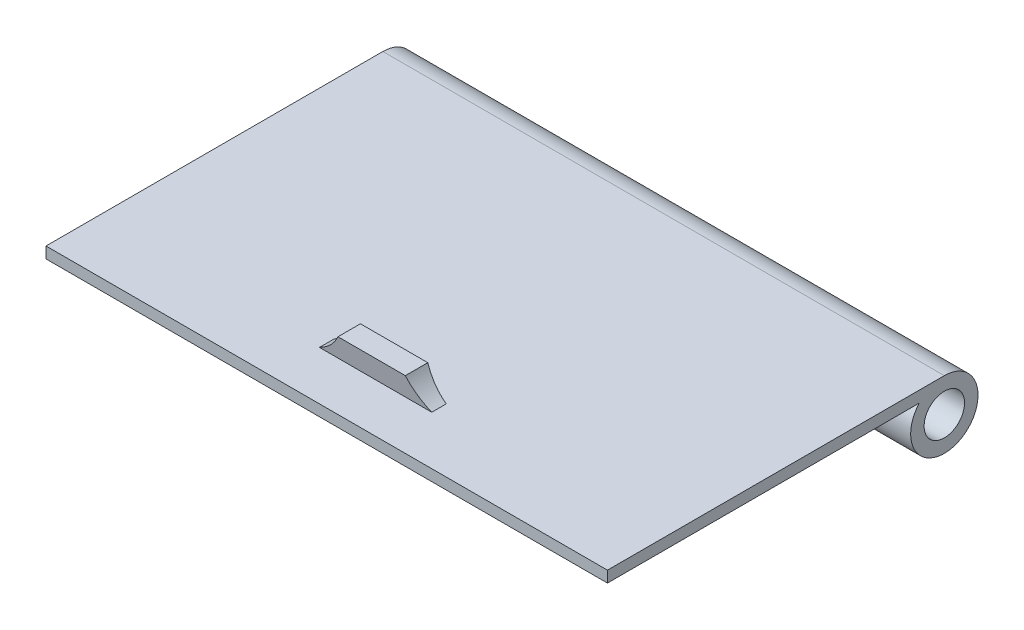
ISO-10303-21;
HEADER;
FILE_DESCRIPTION(('STEP AP214'),'2;1');
FILE_NAME('part.step','',(''),(''),'','','');
FILE_SCHEMA(('AUTOMOTIVE_DESIGN { 1 0 10303 214 1 1 1 1 }'));
ENDSEC;
DATA;
#1=APPLICATION_CONTEXT('core data for automotive mechanical design processes');
#2=APPLICATION_PROTOCOL_DEFINITION('international standard','automotive_design',2000,#1);
#3=PRODUCT_CONTEXT('',#1,'mechanical');
#4=PRODUCT('Part','Part','',(#3));
#5=PRODUCT_RELATED_PRODUCT_CATEGORY('part','',(#4));
#6=PRODUCT_DEFINITION_FORMATION('','',#4);
#7=PRODUCT_DEFINITION_CONTEXT('part definition',#1,'design');
#8=PRODUCT_DEFINITION('design','',#6,#7);
#9=PRODUCT_DEFINITION_SHAPE('','',#8);
#10=(LENGTH_UNIT() NAMED_UNIT(*) SI_UNIT(.MILLI.,.METRE.));
#11=(NAMED_UNIT(*) PLANE_ANGLE_UNIT() SI_UNIT($,.RADIAN.));
#12=(NAMED_UNIT(*) SI_UNIT($,.STERADIAN.) SOLID_ANGLE_UNIT());
#13=UNCERTAINTY_MEASURE_WITH_UNIT(LENGTH_MEASURE(1.E-05),#10,'distance_accuracy_value','');
#14=(GEOMETRIC_REPRESENTATION_CONTEXT(3) GLOBAL_UNCERTAINTY_ASSIGNED_CONTEXT((#13)) GLOBAL_UNIT_ASSIGNED_CONTEXT((#10,
#11,#12)) REPRESENTATION_CONTEXT('',''));
#15=CARTESIAN_POINT('',(0.,0.,0.));
#16=DIRECTION('',(0.,0.,1.));
#17=DIRECTION('',(1.,0.,0.));
#18=AXIS2_PLACEMENT_3D('',#15,#16,#17);
#19=CARTESIAN_POINT('',(0.,2.,0.));
#20=DIRECTION('',(0.,1.,0.));
#21=DIRECTION('',(0.,0.,1.));
#22=AXIS2_PLACEMENT_3D('',#19,#20,#21);
#23=PLANE('',#22);
#24=DIRECTION('',(0.,0.,-1.));
#25=VECTOR('',#24,1.);
#26=CARTESIAN_POINT('',(5.,2.,10.6473460385831));
#27=LINE('',#26,#25);
#28=CARTESIAN_POINT('',(5.,2.,10.6473460385831));
#29=VERTEX_POINT('',#28);
#30=CARTESIAN_POINT('',(5.,2.,9.35265396141693));
#31=VERTEX_POINT('',#30);
#32=EDGE_CURVE('E386',#29,#31,#27,.T.);
#33=ORIENTED_EDGE('',*,*,#32,.F.);
#34=DIRECTION('',(-1.,0.,0.));
#35=VECTOR('',#34,1.);
#36=CARTESIAN_POINT('',(5.,2.,10.6473460385831));
#37=LINE('',#36,#35);
#38=CARTESIAN_POINT('',(-5.,2.,10.6473460385831));
#39=VERTEX_POINT('',#38);
#40=EDGE_CURVE('E145',#29,#39,#37,.T.);
#41=ORIENTED_EDGE('',*,*,#40,.T.);
#42=DIRECTION('',(0.,0.,-1.));
#43=VECTOR('',#42,1.);
#44=CARTESIAN_POINT('',(-5.,2.,10.6473460385831));
#45=LINE('',#44,#43);
#46=CARTESIAN_POINT('',(-5.,2.,9.35265396141693));
#47=VERTEX_POINT('',#46);
#48=EDGE_CURVE('E382',#39,#47,#45,.T.);
#49=ORIENTED_EDGE('',*,*,#48,.T.);
#50=DIRECTION('',(-1.,0.,0.));
#51=VECTOR('',#50,1.);
#52=CARTESIAN_POINT('',(5.,2.,9.35265396141693));
#53=LINE('',#52,#51);
#54=EDGE_CURVE('E137',#31,#47,#53,.T.);
#55=ORIENTED_EDGE('',*,*,#54,.F.);
#56=EDGE_LOOP('',(#33,#41,#49,#55));
#57=FACE_BOUND('',#56,.T.);
#58=DIRECTION('',(1.,0.,0.));
#59=VECTOR('',#58,1.);
#60=CARTESIAN_POINT('',(-25.,2.,15.));
#61=LINE('',#60,#59);
#62=CARTESIAN_POINT('',(-25.,2.,15.));
#63=VERTEX_POINT('',#62);
#64=CARTESIAN_POINT('',(25.,2.,15.));
#65=VERTEX_POINT('',#64);
#66=EDGE_CURVE('E180',#63,#65,#61,.T.);
#67=ORIENTED_EDGE('',*,*,#66,.T.);
#68=DIRECTION('',(0.,0.,-1.));
#69=VECTOR('',#68,1.);
#70=CARTESIAN_POINT('',(25.,2.,15.));
#71=LINE('',#70,#69);
#72=CARTESIAN_POINT('',(25.,2.,-15.));
#73=VERTEX_POINT('',#72);
#74=EDGE_CURVE('E172',#65,#73,#71,.T.);
#75=ORIENTED_EDGE('',*,*,#74,.T.);
#76=DIRECTION('',(-1.,0.,0.));
#77=VECTOR('',#76,1.);
#78=CARTESIAN_POINT('',(25.,2.,-15.));
#79=LINE('',#78,#77);
#80=CARTESIAN_POINT('',(-25.,2.,-15.));
#81=VERTEX_POINT('',#80);
#82=EDGE_CURVE('E175',#73,#81,#79,.T.);
#83=ORIENTED_EDGE('',*,*,#82,.T.);
#84=DIRECTION('',(0.,0.,1.));
#85=VECTOR('',#84,1.);
#86=CARTESIAN_POINT('',(-25.,2.,-15.));
#87=LINE('',#86,#85);
#88=EDGE_CURVE('E178',#81,#63,#87,.T.);
#89=ORIENTED_EDGE('',*,*,#88,.T.);
#90=EDGE_LOOP('',(#67,#75,#83,#89));
#91=FACE_BOUND('',#90,.T.);
#92=ADVANCED_FACE('F33',(#57,#91),#23,.T.);
#93=CARTESIAN_POINT('',(-24.,1.,-14.));
#94=DIRECTION('',(1.,0.,0.));
#95=DIRECTION('',(0.,0.,-1.));
#96=AXIS2_PLACEMENT_3D('',#93,#94,#95);
#97=PLANE('',#96);
#98=DIRECTION('',(0.,0.,1.));
#99=VECTOR('',#98,1.);
#100=CARTESIAN_POINT('',(-24.,1.,-14.));
#101=LINE('',#100,#99);
#102=CARTESIAN_POINT('',(-24.,1.,-12.7639320225002));
#103=VERTEX_POINT('',#102);
#104=CARTESIAN_POINT('',(-24.,1.,14.));
#105=VERTEX_POINT('',#104);
#106=EDGE_CURVE('E195',#103,#105,#101,.T.);
#107=ORIENTED_EDGE('',*,*,#106,.F.);
#108=CARTESIAN_POINT('',(-24.,-1.,-15.));
#109=DIRECTION('',(1.,0.,0.));
#110=DIRECTION('',(0.,0.,-1.));
#111=AXIS2_PLACEMENT_3D('',#108,#109,#110);
#112=CIRCLE('',#111,3.);
#113=CARTESIAN_POINT('',(-24.,0.,-12.1715728752538));
#114=VERTEX_POINT('',#113);
#115=EDGE_CURVE('E169',#103,#114,#112,.T.);
#116=ORIENTED_EDGE('',*,*,#115,.T.);
#117=DIRECTION('',(0.,0.,1.));
#118=VECTOR('',#117,1.);
#119=CARTESIAN_POINT('',(-24.,0.,-14.));
#120=LINE('',#119,#118);
#121=CARTESIAN_POINT('',(-24.,0.,14.));
#122=VERTEX_POINT('',#121);
#123=EDGE_CURVE('E194',#114,#122,#120,.T.);
#124=ORIENTED_EDGE('',*,*,#123,.T.);
#125=DIRECTION('',(0.,-1.,0.));
#126=VECTOR('',#125,1.);
#127=CARTESIAN_POINT('',(-24.,1.,14.));
#128=LINE('',#127,#126);
#129=EDGE_CURVE('E11',#105,#122,#128,.T.);
#130=ORIENTED_EDGE('',*,*,#129,.F.);
#131=EDGE_LOOP('',(#107,#116,#124,#130));
#132=FACE_BOUND('',#131,.T.);
#133=ADVANCED_FACE('F35',(#132),#97,.F.);
#134=CARTESIAN_POINT('',(24.,1.,14.));
#135=DIRECTION('',(0.,0.,1.));
#136=DIRECTION('',(1.,0.,0.));
#137=AXIS2_PLACEMENT_3D('',#134,#135,#136);
#138=PLANE('',#137);
#139=DIRECTION('',(-1.,0.,0.));
#140=VECTOR('',#139,1.);
#141=CARTESIAN_POINT('',(24.,0.,14.));
#142=LINE('',#141,#140);
#143=CARTESIAN_POINT('',(24.,0.,14.));
#144=VERTEX_POINT('',#143);
#145=EDGE_CURVE('E204',#144,#122,#142,.T.);
#146=ORIENTED_EDGE('',*,*,#145,.F.);
#147=DIRECTION('',(0.,-1.,0.));
#148=VECTOR('',#147,1.);
#149=CARTESIAN_POINT('',(24.,1.,14.));
#150=LINE('',#149,#148);
#151=CARTESIAN_POINT('',(24.,1.,14.));
#152=VERTEX_POINT('',#151);
#153=EDGE_CURVE('E41',#152,#144,#150,.T.);
#154=ORIENTED_EDGE('',*,*,#153,.F.);
#155=DIRECTION('',(-1.,0.,0.));
#156=VECTOR('',#155,1.);
#157=CARTESIAN_POINT('',(24.,1.,14.));
#158=LINE('',#157,#156);
#159=EDGE_CURVE('E197',#152,#105,#158,.T.);
#160=ORIENTED_EDGE('',*,*,#159,.T.);
#161=ORIENTED_EDGE('',*,*,#129,.T.);
#162=EDGE_LOOP('',(#146,#154,#160,#161));
#163=FACE_BOUND('',#162,.T.);
#164=ADVANCED_FACE('F217',(#163),#138,.T.);
#165=CARTESIAN_POINT('',(24.,1.,-14.));
#166=DIRECTION('',(1.,0.,0.));
#167=DIRECTION('',(0.,0.,-1.));
#168=AXIS2_PLACEMENT_3D('',#165,#166,#167);
#169=PLANE('',#168);
#170=CARTESIAN_POINT('',(24.,-1.,-15.));
#171=DIRECTION('',(1.,0.,0.));
#172=DIRECTION('',(0.,0.,-1.));
#173=AXIS2_PLACEMENT_3D('',#170,#171,#172);
#174=CIRCLE('',#173,3.);
#175=CARTESIAN_POINT('',(24.,1.,-12.7639320225002));
#176=VERTEX_POINT('',#175);
#177=CARTESIAN_POINT('',(24.,0.,-12.1715728752538));
#178=VERTEX_POINT('',#177);
#179=EDGE_CURVE('E163',#176,#178,#174,.T.);
#180=ORIENTED_EDGE('',*,*,#179,.F.);
#181=DIRECTION('',(0.,0.,1.));
#182=VECTOR('',#181,1.);
#183=CARTESIAN_POINT('',(24.,1.,-14.));
#184=LINE('',#183,#182);
#185=EDGE_CURVE('E201',#176,#152,#184,.T.);
#186=ORIENTED_EDGE('',*,*,#185,.T.);
#187=ORIENTED_EDGE('',*,*,#153,.T.);
#188=DIRECTION('',(0.,0.,1.));
#189=VECTOR('',#188,1.);
#190=CARTESIAN_POINT('',(24.,0.,-14.));
#191=LINE('',#190,#189);
#192=EDGE_CURVE('E198',#178,#144,#191,.T.);
#193=ORIENTED_EDGE('',*,*,#192,.F.);
#194=EDGE_LOOP('',(#180,#186,#187,#193));
#195=FACE_BOUND('',#194,.T.);
#196=ADVANCED_FACE('F213',(#195),#169,.T.);
#197=CARTESIAN_POINT('',(0.,0.,0.));
#198=DIRECTION('',(0.,1.,0.));
#199=DIRECTION('',(0.,0.,1.));
#200=AXIS2_PLACEMENT_3D('',#197,#198,#199);
#201=PLANE('',#200);
#202=ORIENTED_EDGE('',*,*,#123,.F.);
#203=DIRECTION('',(-1.,0.,0.));
#204=VECTOR('',#203,1.);
#205=CARTESIAN_POINT('',(33.4852813742386,0.,-12.1715728752538));
#206=LINE('',#205,#204);
#207=EDGE_CURVE('E166',#114,#178,#206,.F.);
#208=ORIENTED_EDGE('',*,*,#207,.T.);
#209=ORIENTED_EDGE('',*,*,#192,.T.);
#210=ORIENTED_EDGE('',*,*,#145,.T.);
#211=EDGE_LOOP('',(#202,#208,#209,#210));
#212=FACE_BOUND('',#211,.T.);
#213=ADVANCED_FACE('F221',(#212),#201,.F.);
#214=CARTESIAN_POINT('',(0.,1.,0.));
#215=DIRECTION('',(0.,1.,0.));
#216=DIRECTION('',(0.,0.,1.));
#217=AXIS2_PLACEMENT_3D('',#214,#215,#216);
#218=PLANE('',#217);
#219=DIRECTION('',(0.,0.,1.));
#220=VECTOR('',#219,1.);
#221=CARTESIAN_POINT('',(-25.,1.,-15.));
#222=LINE('',#221,#220);
#223=CARTESIAN_POINT('',(-25.,1.,-12.7639320225002));
#224=VERTEX_POINT('',#223);
#225=CARTESIAN_POINT('',(-25.,1.,15.));
#226=VERTEX_POINT('',#225);
#227=EDGE_CURVE('E186',#224,#226,#222,.T.);
#228=ORIENTED_EDGE('',*,*,#227,.F.);
#229=DIRECTION('',(-1.,0.,0.));
#230=VECTOR('',#229,1.);
#231=CARTESIAN_POINT('',(33.4852813742386,1.,-12.7639320225002));
#232=LINE('',#231,#230);
#233=EDGE_CURVE('E164',#224,#103,#232,.F.);
#234=ORIENTED_EDGE('',*,*,#233,.T.);
#235=ORIENTED_EDGE('',*,*,#106,.T.);
#236=ORIENTED_EDGE('',*,*,#159,.F.);
#237=ORIENTED_EDGE('',*,*,#185,.F.);
#238=CARTESIAN_POINT('',(25.,1.,-12.7639320225002));
#239=VERTEX_POINT('',#238);
#240=EDGE_CURVE('E160',#176,#239,#232,.F.);
#241=ORIENTED_EDGE('',*,*,#240,.T.);
#242=DIRECTION('',(0.,0.,-1.));
#243=VECTOR('',#242,1.);
#244=CARTESIAN_POINT('',(25.,1.,15.));
#245=LINE('',#244,#243);
#246=CARTESIAN_POINT('',(25.,1.,15.));
#247=VERTEX_POINT('',#246);
#248=EDGE_CURVE('E183',#247,#239,#245,.T.);
#249=ORIENTED_EDGE('',*,*,#248,.F.);
#250=DIRECTION('',(1.,0.,0.));
#251=VECTOR('',#250,1.);
#252=CARTESIAN_POINT('',(-25.,1.,15.));
#253=LINE('',#252,#251);
#254=EDGE_CURVE('E176',#226,#247,#253,.T.);
#255=ORIENTED_EDGE('',*,*,#254,.F.);
#256=EDGE_LOOP('',(#228,#234,#235,#236,#237,#241,#249,#255));
#257=FACE_BOUND('',#256,.T.);
#258=ADVANCED_FACE('F229',(#257),#218,.F.);
#259=CARTESIAN_POINT('',(25.,2.,15.));
#260=DIRECTION('',(-1.,0.,0.));
#261=DIRECTION('',(0.,0.,1.));
#262=AXIS2_PLACEMENT_3D('',#259,#260,#261);
#263=PLANE('',#262);
#264=CARTESIAN_POINT('',(25.,-1.,-15.));
#265=DIRECTION('',(-1.,0.,0.));
#266=DIRECTION('',(0.,0.,1.));
#267=AXIS2_PLACEMENT_3D('',#264,#265,#266);
#268=CIRCLE('',#267,1.8);
#269=CARTESIAN_POINT('',(25.,-1.,-13.2));
#270=VERTEX_POINT('',#269);
#271=EDGE_CURVE('E149',#270,#270,#268,.T.);
#272=ORIENTED_EDGE('',*,*,#271,.T.);
#273=EDGE_LOOP('',(#272));
#274=FACE_BOUND('',#273,.T.);
#275=ORIENTED_EDGE('',*,*,#248,.T.);
#276=CARTESIAN_POINT('',(25.,-1.,-15.));
#277=DIRECTION('',(-1.,0.,0.));
#278=DIRECTION('',(0.,0.,1.));
#279=AXIS2_PLACEMENT_3D('',#276,#277,#278);
#280=CIRCLE('',#279,3.);
#281=EDGE_CURVE('E157',#239,#73,#280,.F.);
#282=ORIENTED_EDGE('',*,*,#281,.T.);
#283=ORIENTED_EDGE('',*,*,#74,.F.);
#284=DIRECTION('',(0.,-1.,0.));
#285=VECTOR('',#284,1.);
#286=CARTESIAN_POINT('',(25.,2.,15.));
#287=LINE('',#286,#285);
#288=EDGE_CURVE('E182',#65,#247,#287,.T.);
#289=ORIENTED_EDGE('',*,*,#288,.T.);
#290=EDGE_LOOP('',(#275,#282,#283,#289));
#291=FACE_BOUND('',#290,.T.);
#292=ADVANCED_FACE('F241',(#274,#291),#263,.F.);
#293=CARTESIAN_POINT('',(-25.,2.,-15.));
#294=DIRECTION('',(1.,0.,0.));
#295=DIRECTION('',(0.,0.,-1.));
#296=AXIS2_PLACEMENT_3D('',#293,#294,#295);
#297=PLANE('',#296);
#298=CARTESIAN_POINT('',(-25.,-1.,-15.));
#299=DIRECTION('',(-1.,0.,0.));
#300=DIRECTION('',(0.,0.,1.));
#301=AXIS2_PLACEMENT_3D('',#298,#299,#300);
#302=CIRCLE('',#301,1.8);
#303=CARTESIAN_POINT('',(-25.,-1.,-13.2));
#304=VERTEX_POINT('',#303);
#305=EDGE_CURVE('E143',#304,#304,#302,.T.);
#306=ORIENTED_EDGE('',*,*,#305,.F.);
#307=EDGE_LOOP('',(#306));
#308=FACE_BOUND('',#307,.T.);
#309=CARTESIAN_POINT('',(-25.,-1.,-15.));
#310=DIRECTION('',(-1.,0.,0.));
#311=DIRECTION('',(0.,0.,1.));
#312=AXIS2_PLACEMENT_3D('',#309,#310,#311);
#313=CIRCLE('',#312,3.);
#314=EDGE_CURVE('E152',#81,#224,#313,.T.);
#315=ORIENTED_EDGE('',*,*,#314,.T.);
#316=ORIENTED_EDGE('',*,*,#227,.T.);
#317=DIRECTION('',(0.,-1.,0.));
#318=VECTOR('',#317,1.);
#319=CARTESIAN_POINT('',(-25.,2.,15.));
#320=LINE('',#319,#318);
#321=EDGE_CURVE('E191',#63,#226,#320,.T.);
#322=ORIENTED_EDGE('',*,*,#321,.F.);
#323=ORIENTED_EDGE('',*,*,#88,.F.);
#324=EDGE_LOOP('',(#315,#316,#322,#323));
#325=FACE_BOUND('',#324,.T.);
#326=ADVANCED_FACE('F234',(#308,#325),#297,.F.);
#327=CARTESIAN_POINT('',(-25.,2.,15.));
#328=DIRECTION('',(0.,0.,-1.));
#329=DIRECTION('',(-1.,0.,0.));
#330=AXIS2_PLACEMENT_3D('',#327,#328,#329);
#331=PLANE('',#330);
#332=ORIENTED_EDGE('',*,*,#254,.T.);
#333=ORIENTED_EDGE('',*,*,#288,.F.);
#334=ORIENTED_EDGE('',*,*,#66,.F.);
#335=ORIENTED_EDGE('',*,*,#321,.T.);
#336=EDGE_LOOP('',(#332,#333,#334,#335));
#337=FACE_BOUND('',#336,.T.);
#338=ADVANCED_FACE('F244',(#337),#331,.F.);
#339=CARTESIAN_POINT('',(33.4852813742386,-1.,-15.));
#340=DIRECTION('',(-1.,0.,0.));
#341=DIRECTION('',(0.,0.,1.));
#342=AXIS2_PLACEMENT_3D('',#339,#340,#341);
#343=CYLINDRICAL_SURFACE('',#342,3.);
#344=ORIENTED_EDGE('',*,*,#233,.F.);
#345=ORIENTED_EDGE('',*,*,#314,.F.);
#346=ORIENTED_EDGE('',*,*,#82,.F.);
#347=ORIENTED_EDGE('',*,*,#281,.F.);
#348=ORIENTED_EDGE('',*,*,#240,.F.);
#349=ORIENTED_EDGE('',*,*,#179,.T.);
#350=ORIENTED_EDGE('',*,*,#207,.F.);
#351=ORIENTED_EDGE('',*,*,#115,.F.);
#352=EDGE_LOOP('',(#344,#345,#346,#347,#348,#349,#350,#351));
#353=FACE_BOUND('',#352,.T.);
#354=ADVANCED_FACE('F223',(#353),#343,.T.);
#355=CARTESIAN_POINT('',(25.,-1.,-15.));
#356=DIRECTION('',(-1.,0.,0.));
#357=DIRECTION('',(0.,0.,1.));
#358=AXIS2_PLACEMENT_3D('',#355,#356,#357);
#359=CYLINDRICAL_SURFACE('',#358,1.8);
#360=ORIENTED_EDGE('',*,*,#271,.F.);
#361=EDGE_LOOP('',(#360));
#362=FACE_BOUND('',#361,.T.);
#363=ORIENTED_EDGE('',*,*,#305,.T.);
#364=EDGE_LOOP('',(#363));
#365=FACE_BOUND('',#364,.T.);
#366=ADVANCED_FACE('F251',(#362,#365),#359,.F.);
#367=CARTESIAN_POINT('',(5.,4.,9.));
#368=DIRECTION('',(0.,0.173648177666934,0.984807753012208));
#369=DIRECTION('',(0.,-0.984807753012208,0.173648177666934));
#370=AXIS2_PLACEMENT_3D('',#367,#368,#369);
#371=PLANE('',#370);
#372=DIRECTION('',(-1.,0.,0.));
#373=VECTOR('',#372,1.);
#374=CARTESIAN_POINT('',(5.,4.,9.));
#375=LINE('',#374,#373);
#376=CARTESIAN_POINT('',(3.,4.,9.));
#377=VERTEX_POINT('',#376);
#378=CARTESIAN_POINT('',(-3.,4.,9.));
#379=VERTEX_POINT('',#378);
#380=EDGE_CURVE('E135',#377,#379,#375,.T.);
#381=ORIENTED_EDGE('',*,*,#380,.F.);
#382=CARTESIAN_POINT('',(7.39116499156263,6.39116499156263,8.57837309666197));
#383=DIRECTION('',(0.,0.173648177666934,0.984807753012208));
#384=DIRECTION('',(0.,-0.984807753012208,0.173648177666934));
#385=AXIS2_PLACEMENT_3D('',#382,#383,#384);
#386=ELLIPSE('',#385,5.07713305942872,5.);
#387=EDGE_CURVE('E377',#377,#31,#386,.T.);
#388=ORIENTED_EDGE('',*,*,#387,.T.);
#389=ORIENTED_EDGE('',*,*,#54,.T.);
#390=CARTESIAN_POINT('',(-7.39116499156264,6.39116499156263,8.57837309666197));
#391=DIRECTION('',(0.,0.173648177666934,0.984807753012208));
#392=DIRECTION('',(0.,-0.984807753012208,0.173648177666934));
#393=AXIS2_PLACEMENT_3D('',#390,#391,#392);
#394=ELLIPSE('',#393,5.07713305942873,5.);
#395=EDGE_CURVE('E56',#47,#379,#394,.T.);
#396=ORIENTED_EDGE('',*,*,#395,.T.);
#397=EDGE_LOOP('',(#381,#388,#389,#396));
#398=FACE_BOUND('',#397,.T.);
#399=ADVANCED_FACE('F133',(#398),#371,.F.);
#400=CARTESIAN_POINT('',(5.,4.,11.));
#401=DIRECTION('',(0.,-1.,0.));
#402=DIRECTION('',(0.,0.,-1.));
#403=AXIS2_PLACEMENT_3D('',#400,#401,#402);
#404=PLANE('',#403);
#405=DIRECTION('',(-1.,0.,0.));
#406=VECTOR('',#405,1.);
#407=CARTESIAN_POINT('',(5.,4.,11.));
#408=LINE('',#407,#406);
#409=CARTESIAN_POINT('',(3.,4.,11.));
#410=VERTEX_POINT('',#409);
#411=CARTESIAN_POINT('',(-3.,4.,11.));
#412=VERTEX_POINT('',#411);
#413=EDGE_CURVE('E141',#410,#412,#408,.T.);
#414=ORIENTED_EDGE('',*,*,#413,.F.);
#415=DIRECTION('',(0.,0.,1.));
#416=VECTOR('',#415,1.);
#417=CARTESIAN_POINT('',(3.,4.,-18.));
#418=LINE('',#417,#416);
#419=EDGE_CURVE('E128',#377,#410,#418,.T.);
#420=ORIENTED_EDGE('',*,*,#419,.F.);
#421=ORIENTED_EDGE('',*,*,#380,.T.);
#422=DIRECTION('',(0.,0.,1.));
#423=VECTOR('',#422,1.);
#424=CARTESIAN_POINT('',(-3.,4.,-18.));
#425=LINE('',#424,#423);
#426=EDGE_CURVE('E120',#379,#412,#425,.T.);
#427=ORIENTED_EDGE('',*,*,#426,.T.);
#428=EDGE_LOOP('',(#414,#420,#421,#427));
#429=FACE_BOUND('',#428,.T.);
#430=ADVANCED_FACE('F140',(#429),#404,.F.);
#431=CARTESIAN_POINT('',(5.,2.,10.6473460385831));
#432=DIRECTION('',(0.,0.173648177666934,-0.984807753012208));
#433=DIRECTION('',(0.,0.984807753012208,0.173648177666934));
#434=AXIS2_PLACEMENT_3D('',#431,#432,#433);
#435=PLANE('',#434);
#436=ORIENTED_EDGE('',*,*,#40,.F.);
#437=CARTESIAN_POINT('',(7.39116499156263,6.39116499156263,11.421626903338));
#438=DIRECTION('',(0.,0.173648177666934,-0.984807753012208));
#439=DIRECTION('',(0.,0.984807753012208,0.173648177666934));
#440=AXIS2_PLACEMENT_3D('',#437,#438,#439);
#441=ELLIPSE('',#440,5.07713305942872,5.);
#442=EDGE_CURVE('E48',#29,#410,#441,.T.);
#443=ORIENTED_EDGE('',*,*,#442,.T.);
#444=ORIENTED_EDGE('',*,*,#413,.T.);
#445=CARTESIAN_POINT('',(-7.39116499156264,6.39116499156263,11.421626903338));
#446=DIRECTION('',(0.,0.173648177666934,-0.984807753012208));
#447=DIRECTION('',(0.,0.984807753012208,0.173648177666934));
#448=AXIS2_PLACEMENT_3D('',#445,#446,#447);
#449=ELLIPSE('',#448,5.07713305942873,5.);
#450=EDGE_CURVE('E123',#412,#39,#449,.T.);
#451=ORIENTED_EDGE('',*,*,#450,.T.);
#452=EDGE_LOOP('',(#436,#443,#444,#451));
#453=FACE_BOUND('',#452,.T.);
#454=ADVANCED_FACE('F347',(#453),#435,.F.);
#455=CARTESIAN_POINT('',(-7.39116499156264,6.39116499156263,-18.));
#456=DIRECTION('',(0.,0.,1.));
#457=DIRECTION('',(1.,0.,0.));
#458=AXIS2_PLACEMENT_3D('',#455,#456,#457);
#459=CYLINDRICAL_SURFACE('',#458,5.);
#460=ORIENTED_EDGE('',*,*,#48,.F.);
#461=ORIENTED_EDGE('',*,*,#450,.F.);
#462=ORIENTED_EDGE('',*,*,#426,.F.);
#463=ORIENTED_EDGE('',*,*,#395,.F.);
#464=EDGE_LOOP('',(#460,#461,#462,#463));
#465=FACE_BOUND('',#464,.T.);
#466=ADVANCED_FACE('F121',(#465),#459,.F.);
#467=CARTESIAN_POINT('',(7.39116499156263,6.39116499156263,-18.));
#468=DIRECTION('',(0.,0.,1.));
#469=DIRECTION('',(1.,0.,0.));
#470=AXIS2_PLACEMENT_3D('',#467,#468,#469);
#471=CYLINDRICAL_SURFACE('',#470,5.);
#472=ORIENTED_EDGE('',*,*,#419,.T.);
#473=ORIENTED_EDGE('',*,*,#442,.F.);
#474=ORIENTED_EDGE('',*,*,#32,.T.);
#475=ORIENTED_EDGE('',*,*,#387,.F.);
#476=EDGE_LOOP('',(#472,#473,#474,#475));
#477=FACE_BOUND('',#476,.T.);
#478=ADVANCED_FACE('F365',(#477),#471,.F.);
#479=CLOSED_SHELL('',(#92,#133,#164,#196,#213,#258,#292,#326,#338,#354,#366,#399,#430,#454,#466,#478));
#480=MANIFOLD_SOLID_BREP('B2',#479);
#481=ADVANCED_BREP_SHAPE_REPRESENTATION('',(#18,#480),#14);
#482=SHAPE_DEFINITION_REPRESENTATION(#9,#481);
ENDSEC;
END-ISO-10303-21;
